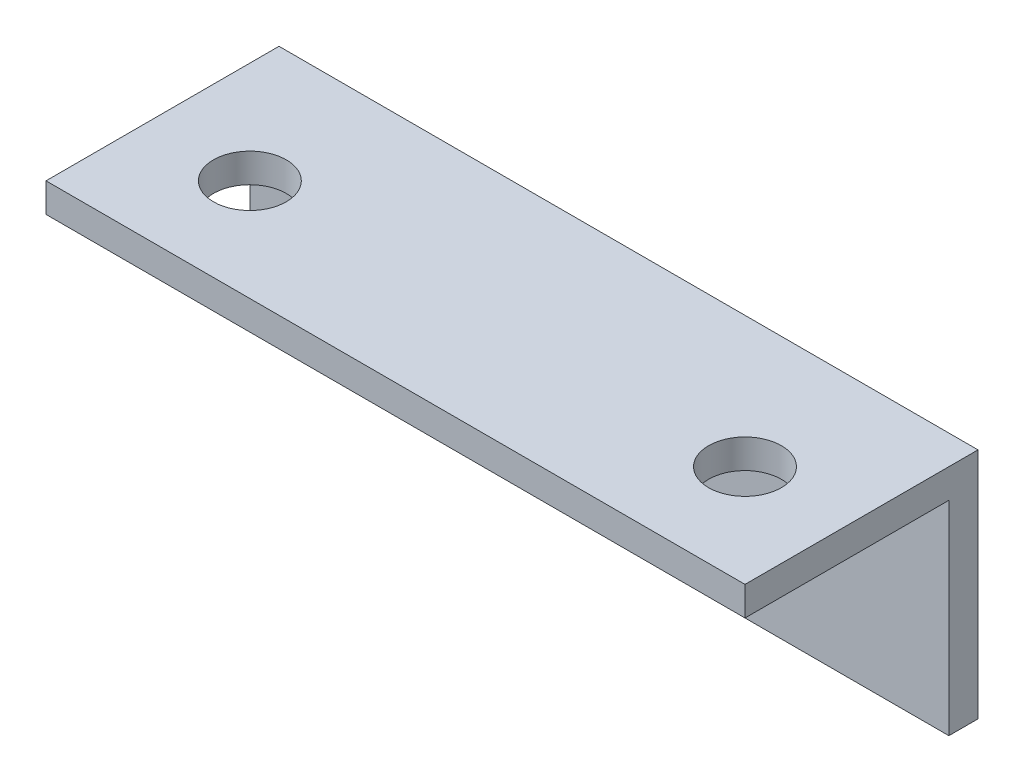
ISO-10303-21;
HEADER;
FILE_DESCRIPTION(('STEP AP214'),'2;1');
FILE_NAME('part.step','',(''),(''),'','','');
FILE_SCHEMA(('AUTOMOTIVE_DESIGN { 1 0 10303 214 1 1 1 1 }'));
ENDSEC;
DATA;
#1=APPLICATION_CONTEXT('core data for automotive mechanical design processes');
#2=APPLICATION_PROTOCOL_DEFINITION('international standard','automotive_design',2000,#1);
#3=PRODUCT_CONTEXT('',#1,'mechanical');
#4=PRODUCT('Part','Part','',(#3));
#5=PRODUCT_RELATED_PRODUCT_CATEGORY('part','',(#4));
#6=PRODUCT_DEFINITION_FORMATION('','',#4);
#7=PRODUCT_DEFINITION_CONTEXT('part definition',#1,'design');
#8=PRODUCT_DEFINITION('design','',#6,#7);
#9=PRODUCT_DEFINITION_SHAPE('','',#8);
#10=(LENGTH_UNIT() NAMED_UNIT(*) SI_UNIT(.MILLI.,.METRE.));
#11=(NAMED_UNIT(*) PLANE_ANGLE_UNIT() SI_UNIT($,.RADIAN.));
#12=(NAMED_UNIT(*) SI_UNIT($,.STERADIAN.) SOLID_ANGLE_UNIT());
#13=UNCERTAINTY_MEASURE_WITH_UNIT(LENGTH_MEASURE(1.E-05),#10,'distance_accuracy_value','');
#14=(GEOMETRIC_REPRESENTATION_CONTEXT(3) GLOBAL_UNCERTAINTY_ASSIGNED_CONTEXT((#13)) GLOBAL_UNIT_ASSIGNED_CONTEXT((#10,
#11,#12)) REPRESENTATION_CONTEXT('',''));
#15=CARTESIAN_POINT('',(0.,0.,0.));
#16=DIRECTION('',(0.,0.,1.));
#17=DIRECTION('',(1.,0.,0.));
#18=AXIS2_PLACEMENT_3D('',#15,#16,#17);
#19=CARTESIAN_POINT('',(38.1,0.,0.));
#20=DIRECTION('',(0.,-1.,0.));
#21=DIRECTION('',(0.,0.,-1.));
#22=AXIS2_PLACEMENT_3D('',#19,#20,#21);
#23=PLANE('',#22);
#24=CARTESIAN_POINT('',(-26.9875,0.,14.2875));
#25=DIRECTION('',(0.,1.,0.));
#26=DIRECTION('',(0.,0.,1.));
#27=AXIS2_PLACEMENT_3D('',#24,#25,#26);
#28=CIRCLE('',#27,3.96874999999999);
#29=CARTESIAN_POINT('',(-26.9875,0.,18.25625));
#30=VERTEX_POINT('',#29);
#31=EDGE_CURVE('E180',#30,#30,#28,.T.);
#32=ORIENTED_EDGE('',*,*,#31,.F.);
#33=EDGE_LOOP('',(#32));
#34=FACE_BOUND('',#33,.T.);
#35=DIRECTION('',(0.,0.,1.));
#36=VECTOR('',#35,1.);
#37=CARTESIAN_POINT('',(-38.1,0.,0.));
#38=LINE('',#37,#36);
#39=CARTESIAN_POINT('',(-38.1,0.,0.));
#40=VERTEX_POINT('',#39);
#41=CARTESIAN_POINT('',(-38.1,0.,25.4));
#42=VERTEX_POINT('',#41);
#43=EDGE_CURVE('E121',#40,#42,#38,.T.);
#44=ORIENTED_EDGE('',*,*,#43,.T.);
#45=DIRECTION('',(-1.,0.,0.));
#46=VECTOR('',#45,1.);
#47=CARTESIAN_POINT('',(38.1,0.,25.4));
#48=LINE('',#47,#46);
#49=CARTESIAN_POINT('',(38.1,0.,25.4));
#50=VERTEX_POINT('',#49);
#51=EDGE_CURVE('E42',#50,#42,#48,.T.);
#52=ORIENTED_EDGE('',*,*,#51,.F.);
#53=DIRECTION('',(0.,0.,1.));
#54=VECTOR('',#53,1.);
#55=CARTESIAN_POINT('',(38.1,0.,0.));
#56=LINE('',#55,#54);
#57=CARTESIAN_POINT('',(38.1,0.,0.));
#58=VERTEX_POINT('',#57);
#59=EDGE_CURVE('E87',#58,#50,#56,.T.);
#60=ORIENTED_EDGE('',*,*,#59,.F.);
#61=DIRECTION('',(-1.,0.,0.));
#62=VECTOR('',#61,1.);
#63=CARTESIAN_POINT('',(38.1,0.,0.));
#64=LINE('',#63,#62);
#65=EDGE_CURVE('E11',#58,#40,#64,.T.);
#66=ORIENTED_EDGE('',*,*,#65,.T.);
#67=EDGE_LOOP('',(#44,#52,#60,#66));
#68=FACE_BOUND('',#67,.T.);
#69=CARTESIAN_POINT('',(26.9875,0.,14.2875));
#70=DIRECTION('',(0.,1.,0.));
#71=DIRECTION('',(0.,0.,1.));
#72=AXIS2_PLACEMENT_3D('',#69,#70,#71);
#73=CIRCLE('',#72,3.96874999999999);
#74=CARTESIAN_POINT('',(26.9875,0.,18.25625));
#75=VERTEX_POINT('',#74);
#76=EDGE_CURVE('E172',#75,#75,#73,.T.);
#77=ORIENTED_EDGE('',*,*,#76,.F.);
#78=EDGE_LOOP('',(#77));
#79=FACE_BOUND('',#78,.T.);
#80=ADVANCED_FACE('F33',(#34,#68,#79),#23,.F.);
#81=CARTESIAN_POINT('',(38.1,0.,0.));
#82=DIRECTION('',(0.,0.,1.));
#83=DIRECTION('',(0.,-1.,0.));
#84=AXIS2_PLACEMENT_3D('',#81,#82,#83);
#85=PLANE('',#84);
#86=DIRECTION('',(0.,1.,0.));
#87=VECTOR('',#86,1.);
#88=CARTESIAN_POINT('',(-38.1,0.,0.));
#89=LINE('',#88,#87);
#90=CARTESIAN_POINT('',(-38.1,-25.4,0.));
#91=VERTEX_POINT('',#90);
#92=EDGE_CURVE('E118',#91,#40,#89,.T.);
#93=ORIENTED_EDGE('',*,*,#92,.T.);
#94=ORIENTED_EDGE('',*,*,#65,.F.);
#95=DIRECTION('',(0.,1.,0.));
#96=VECTOR('',#95,1.);
#97=CARTESIAN_POINT('',(38.1,0.,0.));
#98=LINE('',#97,#96);
#99=CARTESIAN_POINT('',(38.1,-25.4,0.));
#100=VERTEX_POINT('',#99);
#101=EDGE_CURVE('E129',#100,#58,#98,.T.);
#102=ORIENTED_EDGE('',*,*,#101,.F.);
#103=DIRECTION('',(-1.,0.,0.));
#104=VECTOR('',#103,1.);
#105=CARTESIAN_POINT('',(38.1,-25.4,0.));
#106=LINE('',#105,#104);
#107=EDGE_CURVE('E114',#100,#91,#106,.T.);
#108=ORIENTED_EDGE('',*,*,#107,.T.);
#109=EDGE_LOOP('',(#93,#94,#102,#108));
#110=FACE_BOUND('',#109,.T.);
#111=ADVANCED_FACE('F35',(#110),#85,.F.);
#112=CARTESIAN_POINT('',(38.1,-3.175,25.4));
#113=DIRECTION('',(0.,0.,-1.));
#114=DIRECTION('',(-1.,0.,0.));
#115=AXIS2_PLACEMENT_3D('',#112,#113,#114);
#116=PLANE('',#115);
#117=DIRECTION('',(0.,-1.,0.));
#118=VECTOR('',#117,1.);
#119=CARTESIAN_POINT('',(-38.1,-3.175,25.4));
#120=LINE('',#119,#118);
#121=CARTESIAN_POINT('',(-38.1,-3.175,25.4));
#122=VERTEX_POINT('',#121);
#123=EDGE_CURVE('E124',#42,#122,#120,.T.);
#124=ORIENTED_EDGE('',*,*,#123,.T.);
#125=DIRECTION('',(-1.,0.,0.));
#126=VECTOR('',#125,1.);
#127=CARTESIAN_POINT('',(38.1,-3.175,25.4));
#128=LINE('',#127,#126);
#129=CARTESIAN_POINT('',(38.1,-3.175,25.4));
#130=VERTEX_POINT('',#129);
#131=EDGE_CURVE('E109',#130,#122,#128,.T.);
#132=ORIENTED_EDGE('',*,*,#131,.F.);
#133=DIRECTION('',(0.,-1.,0.));
#134=VECTOR('',#133,1.);
#135=CARTESIAN_POINT('',(38.1,-3.175,25.4));
#136=LINE('',#135,#134);
#137=EDGE_CURVE('E100',#50,#130,#136,.T.);
#138=ORIENTED_EDGE('',*,*,#137,.F.);
#139=ORIENTED_EDGE('',*,*,#51,.T.);
#140=EDGE_LOOP('',(#124,#132,#138,#139));
#141=FACE_BOUND('',#140,.T.);
#142=ADVANCED_FACE('F135',(#141),#116,.F.);
#143=CARTESIAN_POINT('',(38.1,-3.175,3.175));
#144=DIRECTION('',(0.,1.,0.));
#145=DIRECTION('',(0.,0.,1.));
#146=AXIS2_PLACEMENT_3D('',#143,#144,#145);
#147=PLANE('',#146);
#148=CARTESIAN_POINT('',(-26.9875,-3.175,14.2875));
#149=DIRECTION('',(0.,1.,0.));
#150=DIRECTION('',(0.,0.,1.));
#151=AXIS2_PLACEMENT_3D('',#148,#149,#150);
#152=CIRCLE('',#151,3.96874999999999);
#153=CARTESIAN_POINT('',(-26.9875,-3.175,18.25625));
#154=VERTEX_POINT('',#153);
#155=EDGE_CURVE('E168',#154,#154,#152,.T.);
#156=ORIENTED_EDGE('',*,*,#155,.T.);
#157=EDGE_LOOP('',(#156));
#158=FACE_BOUND('',#157,.T.);
#159=CARTESIAN_POINT('',(26.9875,-3.175,14.2875));
#160=DIRECTION('',(0.,1.,0.));
#161=DIRECTION('',(0.,0.,1.));
#162=AXIS2_PLACEMENT_3D('',#159,#160,#161);
#163=CIRCLE('',#162,3.96874999999999);
#164=CARTESIAN_POINT('',(26.9875,-3.175,18.25625));
#165=VERTEX_POINT('',#164);
#166=EDGE_CURVE('E122',#165,#165,#163,.T.);
#167=ORIENTED_EDGE('',*,*,#166,.T.);
#168=EDGE_LOOP('',(#167));
#169=FACE_BOUND('',#168,.T.);
#170=DIRECTION('',(0.,0.,-1.));
#171=VECTOR('',#170,1.);
#172=CARTESIAN_POINT('',(-38.1,-3.175,3.175));
#173=LINE('',#172,#171);
#174=CARTESIAN_POINT('',(-38.1,-3.175,3.175));
#175=VERTEX_POINT('',#174);
#176=EDGE_CURVE('E108',#122,#175,#173,.T.);
#177=ORIENTED_EDGE('',*,*,#176,.T.);
#178=DIRECTION('',(-1.,0.,0.));
#179=VECTOR('',#178,1.);
#180=CARTESIAN_POINT('',(38.1,-3.175,3.175));
#181=LINE('',#180,#179);
#182=CARTESIAN_POINT('',(38.1,-3.175,3.175));
#183=VERTEX_POINT('',#182);
#184=EDGE_CURVE('E105',#183,#175,#181,.T.);
#185=ORIENTED_EDGE('',*,*,#184,.F.);
#186=DIRECTION('',(0.,0.,-1.));
#187=VECTOR('',#186,1.);
#188=CARTESIAN_POINT('',(38.1,-3.175,3.175));
#189=LINE('',#188,#187);
#190=EDGE_CURVE('E94',#130,#183,#189,.T.);
#191=ORIENTED_EDGE('',*,*,#190,.F.);
#192=ORIENTED_EDGE('',*,*,#131,.T.);
#193=EDGE_LOOP('',(#177,#185,#191,#192));
#194=FACE_BOUND('',#193,.T.);
#195=ADVANCED_FACE('F106',(#158,#169,#194),#147,.F.);
#196=CARTESIAN_POINT('',(38.1,-25.4,3.175));
#197=DIRECTION('',(0.,0.,-1.));
#198=DIRECTION('',(0.,1.,0.));
#199=AXIS2_PLACEMENT_3D('',#196,#197,#198);
#200=PLANE('',#199);
#201=DIRECTION('',(0.,-1.,0.));
#202=VECTOR('',#201,1.);
#203=CARTESIAN_POINT('',(-38.1,-25.4,3.175));
#204=LINE('',#203,#202);
#205=CARTESIAN_POINT('',(-38.1,-25.4,3.175));
#206=VERTEX_POINT('',#205);
#207=EDGE_CURVE('E73',#175,#206,#204,.T.);
#208=ORIENTED_EDGE('',*,*,#207,.T.);
#209=DIRECTION('',(-1.,0.,0.));
#210=VECTOR('',#209,1.);
#211=CARTESIAN_POINT('',(38.1,-25.4,3.175));
#212=LINE('',#211,#210);
#213=CARTESIAN_POINT('',(38.1,-25.4,3.175));
#214=VERTEX_POINT('',#213);
#215=EDGE_CURVE('E110',#214,#206,#212,.T.);
#216=ORIENTED_EDGE('',*,*,#215,.F.);
#217=DIRECTION('',(0.,-1.,0.));
#218=VECTOR('',#217,1.);
#219=CARTESIAN_POINT('',(38.1,-25.4,3.175));
#220=LINE('',#219,#218);
#221=EDGE_CURVE('E98',#183,#214,#220,.T.);
#222=ORIENTED_EDGE('',*,*,#221,.F.);
#223=ORIENTED_EDGE('',*,*,#184,.T.);
#224=EDGE_LOOP('',(#208,#216,#222,#223));
#225=FACE_BOUND('',#224,.T.);
#226=ADVANCED_FACE('F112',(#225),#200,.F.);
#227=CARTESIAN_POINT('',(38.1,-25.4,0.));
#228=DIRECTION('',(0.,1.,0.));
#229=DIRECTION('',(0.,0.,1.));
#230=AXIS2_PLACEMENT_3D('',#227,#228,#229);
#231=PLANE('',#230);
#232=DIRECTION('',(0.,0.,-1.));
#233=VECTOR('',#232,1.);
#234=CARTESIAN_POINT('',(-38.1,-25.4,0.));
#235=LINE('',#234,#233);
#236=EDGE_CURVE('E79',#206,#91,#235,.T.);
#237=ORIENTED_EDGE('',*,*,#236,.T.);
#238=ORIENTED_EDGE('',*,*,#107,.F.);
#239=DIRECTION('',(0.,0.,-1.));
#240=VECTOR('',#239,1.);
#241=CARTESIAN_POINT('',(38.1,-25.4,0.));
#242=LINE('',#241,#240);
#243=EDGE_CURVE('E50',#214,#100,#242,.T.);
#244=ORIENTED_EDGE('',*,*,#243,.F.);
#245=ORIENTED_EDGE('',*,*,#215,.T.);
#246=EDGE_LOOP('',(#237,#238,#244,#245));
#247=FACE_BOUND('',#246,.T.);
#248=ADVANCED_FACE('F142',(#247),#231,.F.);
#249=CARTESIAN_POINT('',(38.1,0.,0.));
#250=DIRECTION('',(-1.,0.,0.));
#251=DIRECTION('',(0.,0.,1.));
#252=AXIS2_PLACEMENT_3D('',#249,#250,#251);
#253=PLANE('',#252);
#254=ORIENTED_EDGE('',*,*,#101,.T.);
#255=ORIENTED_EDGE('',*,*,#59,.T.);
#256=ORIENTED_EDGE('',*,*,#137,.T.);
#257=ORIENTED_EDGE('',*,*,#190,.T.);
#258=ORIENTED_EDGE('',*,*,#221,.T.);
#259=ORIENTED_EDGE('',*,*,#243,.T.);
#260=EDGE_LOOP('',(#254,#255,#256,#257,#258,#259));
#261=FACE_BOUND('',#260,.T.);
#262=ADVANCED_FACE('F96',(#261),#253,.F.);
#263=CARTESIAN_POINT('',(-38.1,0.,0.));
#264=DIRECTION('',(-1.,0.,0.));
#265=DIRECTION('',(0.,0.,1.));
#266=AXIS2_PLACEMENT_3D('',#263,#264,#265);
#267=PLANE('',#266);
#268=ORIENTED_EDGE('',*,*,#92,.F.);
#269=ORIENTED_EDGE('',*,*,#236,.F.);
#270=ORIENTED_EDGE('',*,*,#207,.F.);
#271=ORIENTED_EDGE('',*,*,#176,.F.);
#272=ORIENTED_EDGE('',*,*,#123,.F.);
#273=ORIENTED_EDGE('',*,*,#43,.F.);
#274=EDGE_LOOP('',(#268,#269,#270,#271,#272,#273));
#275=FACE_BOUND('',#274,.T.);
#276=ADVANCED_FACE('F138',(#275),#267,.T.);
#277=CARTESIAN_POINT('',(26.9875,0.,14.2875));
#278=DIRECTION('',(0.,1.,0.));
#279=DIRECTION('',(0.,0.,1.));
#280=AXIS2_PLACEMENT_3D('',#277,#278,#279);
#281=CYLINDRICAL_SURFACE('',#280,3.96874999999999);
#282=ORIENTED_EDGE('',*,*,#166,.F.);
#283=EDGE_LOOP('',(#282));
#284=FACE_BOUND('',#283,.T.);
#285=ORIENTED_EDGE('',*,*,#76,.T.);
#286=EDGE_LOOP('',(#285));
#287=FACE_BOUND('',#286,.T.);
#288=ADVANCED_FACE('F185',(#284,#287),#281,.F.);
#289=CARTESIAN_POINT('',(-26.9875,0.,14.2875));
#290=DIRECTION('',(0.,1.,0.));
#291=DIRECTION('',(0.,0.,1.));
#292=AXIS2_PLACEMENT_3D('',#289,#290,#291);
#293=CYLINDRICAL_SURFACE('',#292,3.96874999999999);
#294=ORIENTED_EDGE('',*,*,#155,.F.);
#295=EDGE_LOOP('',(#294));
#296=FACE_BOUND('',#295,.T.);
#297=ORIENTED_EDGE('',*,*,#31,.T.);
#298=EDGE_LOOP('',(#297));
#299=FACE_BOUND('',#298,.T.);
#300=ADVANCED_FACE('F183',(#296,#299),#293,.F.);
#301=CLOSED_SHELL('',(#80,#111,#142,#195,#226,#248,#262,#276,#288,#300));
#302=MANIFOLD_SOLID_BREP('B2',#301);
#303=ADVANCED_BREP_SHAPE_REPRESENTATION('',(#18,#302),#14);
#304=SHAPE_DEFINITION_REPRESENTATION(#9,#303);
ENDSEC;
END-ISO-10303-21;
